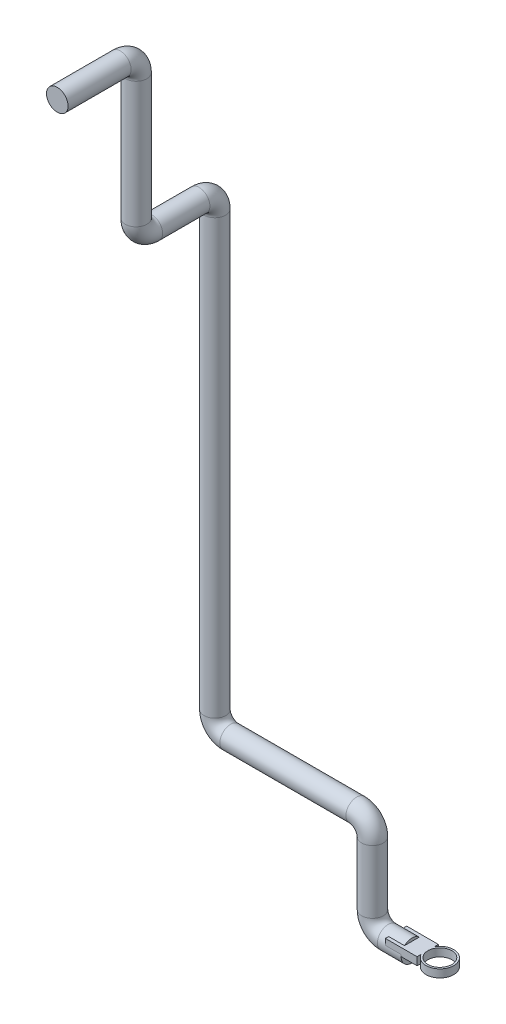
ISO-10303-21;
HEADER;
FILE_DESCRIPTION(('STEP AP214'),'2;1');
FILE_NAME('part.step','',(''),(''),'','','');
FILE_SCHEMA(('AUTOMOTIVE_DESIGN { 1 0 10303 214 1 1 1 1 }'));
ENDSEC;
DATA;
#1=APPLICATION_CONTEXT('core data for automotive mechanical design processes');
#2=APPLICATION_PROTOCOL_DEFINITION('international standard','automotive_design',2000,#1);
#3=PRODUCT_CONTEXT('',#1,'mechanical');
#4=PRODUCT('Part','Part','',(#3));
#5=PRODUCT_RELATED_PRODUCT_CATEGORY('part','',(#4));
#6=PRODUCT_DEFINITION_FORMATION('','',#4);
#7=PRODUCT_DEFINITION_CONTEXT('part definition',#1,'design');
#8=PRODUCT_DEFINITION('design','',#6,#7);
#9=PRODUCT_DEFINITION_SHAPE('','',#8);
#10=(LENGTH_UNIT() NAMED_UNIT(*) SI_UNIT(.MILLI.,.METRE.));
#11=(NAMED_UNIT(*) PLANE_ANGLE_UNIT() SI_UNIT($,.RADIAN.));
#12=(NAMED_UNIT(*) SI_UNIT($,.STERADIAN.) SOLID_ANGLE_UNIT());
#13=UNCERTAINTY_MEASURE_WITH_UNIT(LENGTH_MEASURE(1.E-05),#10,'distance_accuracy_value','');
#14=(GEOMETRIC_REPRESENTATION_CONTEXT(3) GLOBAL_UNCERTAINTY_ASSIGNED_CONTEXT((#13)) GLOBAL_UNIT_ASSIGNED_CONTEXT((#10,
#11,#12)) REPRESENTATION_CONTEXT('',''));
#15=CARTESIAN_POINT('',(0.,0.,0.));
#16=DIRECTION('',(0.,0.,1.));
#17=DIRECTION('',(1.,0.,0.));
#18=AXIS2_PLACEMENT_3D('',#15,#16,#17);
#19=CARTESIAN_POINT('',(20.1080513682243,10.,-13.5123844463082));
#20=DIRECTION('',(-1.,0.,0.));
#21=DIRECTION('',(0.,0.,1.));
#22=AXIS2_PLACEMENT_3D('',#19,#20,#21);
#23=PLANE('',#22);
#24=DIRECTION('',(0.,-1.,0.));
#25=VECTOR('',#24,1.);
#26=CARTESIAN_POINT('',(20.1080513682243,10.,-8.44177710397778));
#27=LINE('',#26,#25);
#28=CARTESIAN_POINT('',(20.1080513682243,0.,-8.44177710397778));
#29=VERTEX_POINT('',#28);
#30=CARTESIAN_POINT('',(20.1080513682243,10.,-8.44177710397778));
#31=VERTEX_POINT('',#30);
#32=EDGE_CURVE('E131',#29,#31,#27,.F.);
#33=ORIENTED_EDGE('',*,*,#32,.F.);
#34=DIRECTION('',(0.,0.,-1.));
#35=VECTOR('',#34,1.);
#36=CARTESIAN_POINT('',(20.1080513682243,0.,-13.5123844463082));
#37=LINE('',#36,#35);
#38=CARTESIAN_POINT('',(20.1080513682243,0.,-13.5123844463082));
#39=VERTEX_POINT('',#38);
#40=EDGE_CURVE('E121',#29,#39,#37,.T.);
#41=ORIENTED_EDGE('',*,*,#40,.T.);
#42=DIRECTION('',(0.,-1.,0.));
#43=VECTOR('',#42,1.);
#44=CARTESIAN_POINT('',(20.1080513682243,10.,-13.5123844463082));
#45=LINE('',#44,#43);
#46=CARTESIAN_POINT('',(20.1080513682243,10.,-13.5123844463082));
#47=VERTEX_POINT('',#46);
#48=EDGE_CURVE('E171',#47,#39,#45,.T.);
#49=ORIENTED_EDGE('',*,*,#48,.F.);
#50=DIRECTION('',(0.,0.,-1.));
#51=VECTOR('',#50,1.);
#52=CARTESIAN_POINT('',(20.1080513682243,10.,-13.5123844463082));
#53=LINE('',#52,#51);
#54=EDGE_CURVE('E51',#31,#47,#53,.T.);
#55=ORIENTED_EDGE('',*,*,#54,.F.);
#56=EDGE_LOOP('',(#33,#41,#49,#55));
#57=FACE_BOUND('',#56,.T.);
#58=ADVANCED_FACE('F36',(#57),#23,.F.);
#59=DIRECTION('',(0.,-1.,0.));
#60=VECTOR('',#59,1.);
#61=CARTESIAN_POINT('',(20.1080513682243,10.,8.44177710397778));
#62=LINE('',#61,#60);
#63=CARTESIAN_POINT('',(20.1080513682243,10.,8.44177710397778));
#64=VERTEX_POINT('',#63);
#65=CARTESIAN_POINT('',(20.1080513682243,0.,8.44177710397778));
#66=VERTEX_POINT('',#65);
#67=EDGE_CURVE('E59',#64,#66,#62,.T.);
#68=ORIENTED_EDGE('',*,*,#67,.F.);
#69=CARTESIAN_POINT('',(20.1080513682243,10.,13.5123844463082));
#70=VERTEX_POINT('',#69);
#71=EDGE_CURVE('E149',#70,#64,#53,.T.);
#72=ORIENTED_EDGE('',*,*,#71,.F.);
#73=DIRECTION('',(0.,-1.,0.));
#74=VECTOR('',#73,1.);
#75=CARTESIAN_POINT('',(20.1080513682243,10.,13.5123844463082));
#76=LINE('',#75,#74);
#77=CARTESIAN_POINT('',(20.1080513682243,0.,13.5123844463082));
#78=VERTEX_POINT('',#77);
#79=EDGE_CURVE('E158',#70,#78,#76,.T.);
#80=ORIENTED_EDGE('',*,*,#79,.T.);
#81=EDGE_CURVE('E130',#78,#66,#37,.T.);
#82=ORIENTED_EDGE('',*,*,#81,.T.);
#83=EDGE_LOOP('',(#68,#72,#80,#82));
#84=FACE_BOUND('',#83,.T.);
#85=ADVANCED_FACE('F278',(#84),#23,.F.);
#86=CARTESIAN_POINT('',(0.,0.,0.));
#87=DIRECTION('',(1.,0.,0.));
#88=DIRECTION('',(0.,0.,-1.));
#89=AXIS2_PLACEMENT_3D('',#86,#87,#88);
#90=PLANE('',#89);
#91=CARTESIAN_POINT('',(0.,0.,0.));
#92=DIRECTION('',(1.,0.,0.));
#93=DIRECTION('',(0.,0.,-1.));
#94=AXIS2_PLACEMENT_3D('',#91,#92,#93);
#95=CIRCLE('',#94,13.7);
#96=CARTESIAN_POINT('',(0.,0.,-13.7));
#97=VERTEX_POINT('',#96);
#98=CARTESIAN_POINT('',(0.,2.25952795405754,-13.5123844463082));
#99=VERTEX_POINT('',#98);
#100=EDGE_CURVE('E182',#97,#99,#95,.T.);
#101=ORIENTED_EDGE('',*,*,#100,.T.);
#102=DIRECTION('',(0.,-1.,0.));
#103=VECTOR('',#102,1.);
#104=CARTESIAN_POINT('',(0.,0.,-13.5123844463082));
#105=LINE('',#104,#103);
#106=CARTESIAN_POINT('',(0.,0.,-13.5123844463082));
#107=VERTEX_POINT('',#106);
#108=EDGE_CURVE('E178',#99,#107,#105,.T.);
#109=ORIENTED_EDGE('',*,*,#108,.T.);
#110=DIRECTION('',(0.,0.,1.));
#111=VECTOR('',#110,1.);
#112=CARTESIAN_POINT('',(0.,0.,0.));
#113=LINE('',#112,#111);
#114=CARTESIAN_POINT('',(0.,0.,13.5123844463082));
#115=VERTEX_POINT('',#114);
#116=EDGE_CURVE('E11',#107,#115,#113,.T.);
#117=ORIENTED_EDGE('',*,*,#116,.T.);
#118=DIRECTION('',(0.,1.,0.));
#119=VECTOR('',#118,1.);
#120=CARTESIAN_POINT('',(0.,0.,13.5123844463082));
#121=LINE('',#120,#119);
#122=CARTESIAN_POINT('',(0.,2.25952795405754,13.5123844463082));
#123=VERTEX_POINT('',#122);
#124=EDGE_CURVE('E175',#115,#123,#121,.T.);
#125=ORIENTED_EDGE('',*,*,#124,.T.);
#126=EDGE_CURVE('E181',#123,#97,#95,.T.);
#127=ORIENTED_EDGE('',*,*,#126,.T.);
#128=EDGE_LOOP('',(#101,#109,#117,#125,#127));
#129=FACE_BOUND('',#128,.T.);
#130=ADVANCED_FACE('F255',(#129),#90,.T.);
#131=CARTESIAN_POINT('',(0.,0.,0.));
#132=DIRECTION('',(-1.,0.,0.));
#133=DIRECTION('',(0.,0.,1.));
#134=AXIS2_PLACEMENT_3D('',#131,#132,#133);
#135=CYLINDRICAL_SURFACE('',#134,13.7);
#136=CARTESIAN_POINT('',(-30.,0.,0.));
#137=DIRECTION('',(1.,0.,0.));
#138=DIRECTION('',(0.,0.,-1.));
#139=AXIS2_PLACEMENT_3D('',#136,#137,#138);
#140=CIRCLE('',#139,13.7);
#141=CARTESIAN_POINT('',(-30.,-13.7,0.));
#142=VERTEX_POINT('',#141);
#143=EDGE_CURVE('E185',#142,#142,#140,.T.);
#144=ORIENTED_EDGE('',*,*,#143,.T.);
#145=EDGE_LOOP('',(#144));
#146=FACE_BOUND('',#145,.T.);
#147=DIRECTION('',(-1.,0.,0.));
#148=VECTOR('',#147,1.);
#149=CARTESIAN_POINT('',(0.,2.25952795405754,-13.5123844463082));
#150=LINE('',#149,#148);
#151=CARTESIAN_POINT('',(-20.1080513682243,2.25952795405754,-13.5123844463082));
#152=VERTEX_POINT('',#151);
#153=EDGE_CURVE('E44',#99,#152,#150,.T.);
#154=ORIENTED_EDGE('',*,*,#153,.F.);
#155=ORIENTED_EDGE('',*,*,#100,.F.);
#156=ORIENTED_EDGE('',*,*,#126,.F.);
#157=DIRECTION('',(-1.,0.,0.));
#158=VECTOR('',#157,1.);
#159=CARTESIAN_POINT('',(0.,2.25952795405754,13.5123844463082));
#160=LINE('',#159,#158);
#161=CARTESIAN_POINT('',(-20.1080513682243,2.25952795405754,13.5123844463082));
#162=VERTEX_POINT('',#161);
#163=EDGE_CURVE('E229',#162,#123,#160,.F.);
#164=ORIENTED_EDGE('',*,*,#163,.F.);
#165=CARTESIAN_POINT('',(-20.1080513682243,0.,0.));
#166=DIRECTION('',(1.,0.,0.));
#167=DIRECTION('',(0.,0.,-1.));
#168=AXIS2_PLACEMENT_3D('',#165,#166,#167);
#169=CIRCLE('',#168,13.7);
#170=CARTESIAN_POINT('',(-20.1080513682243,10.,9.36429388688757));
#171=VERTEX_POINT('',#170);
#172=EDGE_CURVE('E227',#171,#162,#169,.T.);
#173=ORIENTED_EDGE('',*,*,#172,.F.);
#174=DIRECTION('',(-1.,0.,0.));
#175=VECTOR('',#174,1.);
#176=CARTESIAN_POINT('',(0.,10.,9.36429388688757));
#177=LINE('',#176,#175);
#178=CARTESIAN_POINT('',(0.,10.,9.36429388688757));
#179=VERTEX_POINT('',#178);
#180=EDGE_CURVE('E224',#171,#179,#177,.F.);
#181=ORIENTED_EDGE('',*,*,#180,.T.);
#182=CARTESIAN_POINT('',(0.,10.,-9.36429388688757));
#183=VERTEX_POINT('',#182);
#184=EDGE_CURVE('E186',#183,#179,#95,.T.);
#185=ORIENTED_EDGE('',*,*,#184,.F.);
#186=DIRECTION('',(-1.,0.,0.));
#187=VECTOR('',#186,1.);
#188=CARTESIAN_POINT('',(0.,10.,-9.36429388688757));
#189=LINE('',#188,#187);
#190=CARTESIAN_POINT('',(-20.1080513682243,10.,-9.36429388688757));
#191=VERTEX_POINT('',#190);
#192=EDGE_CURVE('E232',#183,#191,#189,.T.);
#193=ORIENTED_EDGE('',*,*,#192,.T.);
#194=EDGE_CURVE('E230',#152,#191,#169,.T.);
#195=ORIENTED_EDGE('',*,*,#194,.F.);
#196=EDGE_LOOP('',(#154,#155,#156,#164,#173,#181,#185,#193,#195));
#197=FACE_BOUND('',#196,.T.);
#198=ADVANCED_FACE('F248',(#146,#197),#135,.T.);
#199=DIRECTION('',(0.,0.,1.));
#200=VECTOR('',#199,1.);
#201=CARTESIAN_POINT('',(0.,10.,0.));
#202=LINE('',#201,#200);
#203=EDGE_CURVE('E173',#183,#179,#202,.T.);
#204=ORIENTED_EDGE('',*,*,#203,.F.);
#205=ORIENTED_EDGE('',*,*,#184,.T.);
#206=EDGE_LOOP('',(#204,#205));
#207=FACE_BOUND('',#206,.T.);
#208=ADVANCED_FACE('F38',(#207),#90,.T.);
#209=CARTESIAN_POINT('',(-250.,909.98,200.));
#210=DIRECTION('',(0.,0.,-1.));
#211=DIRECTION('',(0.,1.,0.));
#212=AXIS2_PLACEMENT_3D('',#209,#210,#211);
#213=PLANE('',#212);
#214=CARTESIAN_POINT('',(-250.,909.98,200.));
#215=DIRECTION('',(0.,0.,-1.));
#216=DIRECTION('',(0.,1.,0.));
#217=AXIS2_PLACEMENT_3D('',#214,#215,#216);
#218=CIRCLE('',#217,13.7);
#219=CARTESIAN_POINT('',(-250.,923.68,200.));
#220=VERTEX_POINT('',#219);
#221=EDGE_CURVE('E222',#220,#220,#218,.T.);
#222=ORIENTED_EDGE('',*,*,#221,.F.);
#223=EDGE_LOOP('',(#222));
#224=FACE_BOUND('',#223,.T.);
#225=ADVANCED_FACE('F267',(#224),#213,.F.);
#226=CARTESIAN_POINT('',(-30.,20.,0.));
#227=DIRECTION('',(0.,0.,-1.));
#228=DIRECTION('',(-1.,0.,0.));
#229=AXIS2_PLACEMENT_3D('',#226,#227,#228);
#230=TOROIDAL_SURFACE('',#229,20.,13.7);
#231=CARTESIAN_POINT('',(-50.,20.,0.));
#232=DIRECTION('',(0.,-1.,0.));
#233=DIRECTION('',(0.,0.,-1.));
#234=AXIS2_PLACEMENT_3D('',#231,#232,#233);
#235=CIRCLE('',#234,13.7);
#236=CARTESIAN_POINT('',(-63.7,20.,0.));
#237=VERTEX_POINT('',#236);
#238=EDGE_CURVE('E189',#237,#237,#235,.T.);
#239=CARTESIAN_POINT('',(-30.,20.,0.));
#240=DIRECTION('',(0.,0.,-1.));
#241=DIRECTION('',(-1.,0.,0.));
#242=AXIS2_PLACEMENT_3D('',#239,#240,#241);
#243=CIRCLE('',#242,33.7);
#244=EDGE_CURVE('',#142,#237,#243,.T.);
#245=ORIENTED_EDGE('',*,*,#143,.F.);
#246=ORIENTED_EDGE('',*,*,#238,.T.);
#247=ORIENTED_EDGE('',*,*,#244,.T.);
#248=ORIENTED_EDGE('',*,*,#244,.F.);
#249=EDGE_LOOP('',(#245,#247,#246,#248));
#250=FACE_BOUND('',#249,.T.);
#251=ADVANCED_FACE('F272',(#250),#230,.T.);
#252=CARTESIAN_POINT('',(-50.,20.,0.));
#253=DIRECTION('',(0.,1.,0.));
#254=DIRECTION('',(0.,0.,1.));
#255=AXIS2_PLACEMENT_3D('',#252,#253,#254);
#256=CYLINDRICAL_SURFACE('',#255,13.7);
#257=CARTESIAN_POINT('',(-50.,100.,0.));
#258=DIRECTION('',(0.,-1.,0.));
#259=DIRECTION('',(0.,0.,-1.));
#260=AXIS2_PLACEMENT_3D('',#257,#258,#259);
#261=CIRCLE('',#260,13.7);
#262=CARTESIAN_POINT('',(-36.3,100.,0.));
#263=VERTEX_POINT('',#262);
#264=EDGE_CURVE('E192',#263,#263,#261,.T.);
#265=ORIENTED_EDGE('',*,*,#264,.T.);
#266=EDGE_LOOP('',(#265));
#267=FACE_BOUND('',#266,.T.);
#268=ORIENTED_EDGE('',*,*,#238,.F.);
#269=EDGE_LOOP('',(#268));
#270=FACE_BOUND('',#269,.T.);
#271=ADVANCED_FACE('F291',(#267,#270),#256,.T.);
#272=CARTESIAN_POINT('',(-70.,100.,0.));
#273=DIRECTION('',(0.,0.,1.));
#274=DIRECTION('',(1.,0.,0.));
#275=AXIS2_PLACEMENT_3D('',#272,#273,#274);
#276=TOROIDAL_SURFACE('',#275,20.,13.7);
#277=CARTESIAN_POINT('',(-70.,120.,0.));
#278=DIRECTION('',(1.,0.,0.));
#279=DIRECTION('',(0.,0.,-1.));
#280=AXIS2_PLACEMENT_3D('',#277,#278,#279);
#281=CIRCLE('',#280,13.7);
#282=CARTESIAN_POINT('',(-70.,133.7,0.));
#283=VERTEX_POINT('',#282);
#284=EDGE_CURVE('E195',#283,#283,#281,.T.);
#285=CARTESIAN_POINT('',(-70.,100.,0.));
#286=DIRECTION('',(0.,0.,1.));
#287=DIRECTION('',(1.,0.,0.));
#288=AXIS2_PLACEMENT_3D('',#285,#286,#287);
#289=CIRCLE('',#288,33.7);
#290=EDGE_CURVE('',#263,#283,#289,.T.);
#291=ORIENTED_EDGE('',*,*,#264,.F.);
#292=ORIENTED_EDGE('',*,*,#284,.T.);
#293=ORIENTED_EDGE('',*,*,#290,.T.);
#294=ORIENTED_EDGE('',*,*,#290,.F.);
#295=EDGE_LOOP('',(#291,#293,#292,#294));
#296=FACE_BOUND('',#295,.T.);
#297=ADVANCED_FACE('F295',(#296),#276,.T.);
#298=CARTESIAN_POINT('',(-70.,120.,0.));
#299=DIRECTION('',(-1.,0.,0.));
#300=DIRECTION('',(0.,-1.,0.));
#301=AXIS2_PLACEMENT_3D('',#298,#299,#300);
#302=CYLINDRICAL_SURFACE('',#301,13.7);
#303=CARTESIAN_POINT('',(-230.,120.,0.));
#304=DIRECTION('',(1.,0.,0.));
#305=DIRECTION('',(0.,0.,-1.));
#306=AXIS2_PLACEMENT_3D('',#303,#304,#305);
#307=CIRCLE('',#306,13.7);
#308=CARTESIAN_POINT('',(-230.,106.3,0.));
#309=VERTEX_POINT('',#308);
#310=EDGE_CURVE('E198',#309,#309,#307,.T.);
#311=ORIENTED_EDGE('',*,*,#310,.T.);
#312=EDGE_LOOP('',(#311));
#313=FACE_BOUND('',#312,.T.);
#314=ORIENTED_EDGE('',*,*,#284,.F.);
#315=EDGE_LOOP('',(#314));
#316=FACE_BOUND('',#315,.T.);
#317=ADVANCED_FACE('F299',(#313,#316),#302,.T.);
#318=CARTESIAN_POINT('',(-230.,140.,0.));
#319=DIRECTION('',(0.,0.,-1.));
#320=DIRECTION('',(-1.,0.,0.));
#321=AXIS2_PLACEMENT_3D('',#318,#319,#320);
#322=TOROIDAL_SURFACE('',#321,20.,13.7);
#323=CARTESIAN_POINT('',(-250.,140.,0.));
#324=DIRECTION('',(0.,-1.,0.));
#325=DIRECTION('',(0.,0.,-1.));
#326=AXIS2_PLACEMENT_3D('',#323,#324,#325);
#327=CIRCLE('',#326,13.7);
#328=CARTESIAN_POINT('',(-263.7,140.,0.));
#329=VERTEX_POINT('',#328);
#330=EDGE_CURVE('E201',#329,#329,#327,.T.);
#331=CARTESIAN_POINT('',(-230.,140.,0.));
#332=DIRECTION('',(0.,0.,-1.));
#333=DIRECTION('',(-1.,0.,0.));
#334=AXIS2_PLACEMENT_3D('',#331,#332,#333);
#335=CIRCLE('',#334,33.7);
#336=EDGE_CURVE('',#309,#329,#335,.T.);
#337=ORIENTED_EDGE('',*,*,#310,.F.);
#338=ORIENTED_EDGE('',*,*,#330,.T.);
#339=ORIENTED_EDGE('',*,*,#336,.T.);
#340=ORIENTED_EDGE('',*,*,#336,.F.);
#341=EDGE_LOOP('',(#337,#339,#338,#340));
#342=FACE_BOUND('',#341,.T.);
#343=ADVANCED_FACE('F303',(#342),#322,.T.);
#344=CARTESIAN_POINT('',(-250.,140.,0.));
#345=DIRECTION('',(0.,1.,0.));
#346=DIRECTION('',(0.,0.,1.));
#347=AXIS2_PLACEMENT_3D('',#344,#345,#346);
#348=CYLINDRICAL_SURFACE('',#347,13.7);
#349=CARTESIAN_POINT('',(-250.,689.98,0.));
#350=DIRECTION('',(0.,-1.,0.));
#351=DIRECTION('',(0.,0.,-1.));
#352=AXIS2_PLACEMENT_3D('',#349,#350,#351);
#353=CIRCLE('',#352,13.7);
#354=CARTESIAN_POINT('',(-250.,689.98,-13.7));
#355=VERTEX_POINT('',#354);
#356=EDGE_CURVE('E204',#355,#355,#353,.T.);
#357=ORIENTED_EDGE('',*,*,#356,.T.);
#358=EDGE_LOOP('',(#357));
#359=FACE_BOUND('',#358,.T.);
#360=ORIENTED_EDGE('',*,*,#330,.F.);
#361=EDGE_LOOP('',(#360));
#362=FACE_BOUND('',#361,.T.);
#363=ADVANCED_FACE('F307',(#359,#362),#348,.T.);
#364=CARTESIAN_POINT('',(-250.,689.98,20.));
#365=DIRECTION('',(1.,0.,0.));
#366=DIRECTION('',(0.,0.,-1.));
#367=AXIS2_PLACEMENT_3D('',#364,#365,#366);
#368=TOROIDAL_SURFACE('',#367,20.,13.7);
#369=CARTESIAN_POINT('',(-250.,709.98,20.));
#370=DIRECTION('',(0.,0.,-1.));
#371=DIRECTION('',(0.,1.,0.));
#372=AXIS2_PLACEMENT_3D('',#369,#370,#371);
#373=CIRCLE('',#372,13.7);
#374=CARTESIAN_POINT('',(-250.,723.68,20.));
#375=VERTEX_POINT('',#374);
#376=EDGE_CURVE('E207',#375,#375,#373,.T.);
#377=CARTESIAN_POINT('',(-250.,689.98,20.));
#378=DIRECTION('',(1.,0.,0.));
#379=DIRECTION('',(0.,0.,-1.));
#380=AXIS2_PLACEMENT_3D('',#377,#378,#379);
#381=CIRCLE('',#380,33.7);
#382=EDGE_CURVE('',#355,#375,#381,.T.);
#383=ORIENTED_EDGE('',*,*,#356,.F.);
#384=ORIENTED_EDGE('',*,*,#376,.T.);
#385=ORIENTED_EDGE('',*,*,#382,.T.);
#386=ORIENTED_EDGE('',*,*,#382,.F.);
#387=EDGE_LOOP('',(#383,#385,#384,#386));
#388=FACE_BOUND('',#387,.T.);
#389=ADVANCED_FACE('F311',(#388),#368,.T.);
#390=CARTESIAN_POINT('',(-250.,709.98,20.));
#391=DIRECTION('',(0.,0.,1.));
#392=DIRECTION('',(1.,0.,0.));
#393=AXIS2_PLACEMENT_3D('',#390,#391,#392);
#394=CYLINDRICAL_SURFACE('',#393,13.7);
#395=CARTESIAN_POINT('',(-250.,709.98,80.));
#396=DIRECTION('',(0.,0.,-1.));
#397=DIRECTION('',(0.,1.,0.));
#398=AXIS2_PLACEMENT_3D('',#395,#396,#397);
#399=CIRCLE('',#398,13.7);
#400=CARTESIAN_POINT('',(-250.,696.28,80.));
#401=VERTEX_POINT('',#400);
#402=EDGE_CURVE('E210',#401,#401,#399,.T.);
#403=ORIENTED_EDGE('',*,*,#402,.T.);
#404=EDGE_LOOP('',(#403));
#405=FACE_BOUND('',#404,.T.);
#406=ORIENTED_EDGE('',*,*,#376,.F.);
#407=EDGE_LOOP('',(#406));
#408=FACE_BOUND('',#407,.T.);
#409=ADVANCED_FACE('F315',(#405,#408),#394,.T.);
#410=CARTESIAN_POINT('',(-250.,729.98,80.));
#411=DIRECTION('',(-1.,0.,0.));
#412=DIRECTION('',(0.,0.,1.));
#413=AXIS2_PLACEMENT_3D('',#410,#411,#412);
#414=TOROIDAL_SURFACE('',#413,20.,13.7);
#415=CARTESIAN_POINT('',(-250.,729.98,100.));
#416=DIRECTION('',(0.,-1.,0.));
#417=DIRECTION('',(0.,0.,-1.));
#418=AXIS2_PLACEMENT_3D('',#415,#416,#417);
#419=CIRCLE('',#418,13.7);
#420=CARTESIAN_POINT('',(-250.,729.98,113.7));
#421=VERTEX_POINT('',#420);
#422=EDGE_CURVE('E213',#421,#421,#419,.T.);
#423=CARTESIAN_POINT('',(-250.,729.98,80.));
#424=DIRECTION('',(-1.,0.,0.));
#425=DIRECTION('',(0.,0.,1.));
#426=AXIS2_PLACEMENT_3D('',#423,#424,#425);
#427=CIRCLE('',#426,33.7);
#428=EDGE_CURVE('',#401,#421,#427,.T.);
#429=ORIENTED_EDGE('',*,*,#402,.F.);
#430=ORIENTED_EDGE('',*,*,#422,.T.);
#431=ORIENTED_EDGE('',*,*,#428,.T.);
#432=ORIENTED_EDGE('',*,*,#428,.F.);
#433=EDGE_LOOP('',(#429,#431,#430,#432));
#434=FACE_BOUND('',#433,.T.);
#435=ADVANCED_FACE('F319',(#434),#414,.T.);
#436=CARTESIAN_POINT('',(-250.,729.98,100.));
#437=DIRECTION('',(0.,1.,0.));
#438=DIRECTION('',(0.,0.,1.));
#439=AXIS2_PLACEMENT_3D('',#436,#437,#438);
#440=CYLINDRICAL_SURFACE('',#439,13.7);
#441=CARTESIAN_POINT('',(-250.,889.98,100.));
#442=DIRECTION('',(0.,-1.,0.));
#443=DIRECTION('',(0.,0.,-1.));
#444=AXIS2_PLACEMENT_3D('',#441,#442,#443);
#445=CIRCLE('',#444,13.7);
#446=CARTESIAN_POINT('',(-250.,889.98,86.3));
#447=VERTEX_POINT('',#446);
#448=EDGE_CURVE('E216',#447,#447,#445,.T.);
#449=ORIENTED_EDGE('',*,*,#448,.T.);
#450=EDGE_LOOP('',(#449));
#451=FACE_BOUND('',#450,.T.);
#452=ORIENTED_EDGE('',*,*,#422,.F.);
#453=EDGE_LOOP('',(#452));
#454=FACE_BOUND('',#453,.T.);
#455=ADVANCED_FACE('F323',(#451,#454),#440,.T.);
#456=CARTESIAN_POINT('',(-250.,889.98,120.));
#457=DIRECTION('',(1.,0.,0.));
#458=DIRECTION('',(0.,0.,-1.));
#459=AXIS2_PLACEMENT_3D('',#456,#457,#458);
#460=TOROIDAL_SURFACE('',#459,20.,13.7);
#461=CARTESIAN_POINT('',(-250.,909.98,120.));
#462=DIRECTION('',(0.,0.,-1.));
#463=DIRECTION('',(0.,1.,0.));
#464=AXIS2_PLACEMENT_3D('',#461,#462,#463);
#465=CIRCLE('',#464,13.7);
#466=CARTESIAN_POINT('',(-250.,923.68,120.));
#467=VERTEX_POINT('',#466);
#468=EDGE_CURVE('E219',#467,#467,#465,.T.);
#469=CARTESIAN_POINT('',(-250.,889.98,120.));
#470=DIRECTION('',(1.,0.,0.));
#471=DIRECTION('',(0.,0.,-1.));
#472=AXIS2_PLACEMENT_3D('',#469,#470,#471);
#473=CIRCLE('',#472,33.7);
#474=EDGE_CURVE('',#447,#467,#473,.T.);
#475=ORIENTED_EDGE('',*,*,#448,.F.);
#476=ORIENTED_EDGE('',*,*,#468,.T.);
#477=ORIENTED_EDGE('',*,*,#474,.T.);
#478=ORIENTED_EDGE('',*,*,#474,.F.);
#479=EDGE_LOOP('',(#475,#477,#476,#478));
#480=FACE_BOUND('',#479,.T.);
#481=ADVANCED_FACE('F327',(#480),#460,.T.);
#482=CARTESIAN_POINT('',(-250.,909.98,120.));
#483=DIRECTION('',(0.,0.,1.));
#484=DIRECTION('',(1.,0.,0.));
#485=AXIS2_PLACEMENT_3D('',#482,#483,#484);
#486=CYLINDRICAL_SURFACE('',#485,13.7);
#487=ORIENTED_EDGE('',*,*,#221,.T.);
#488=EDGE_LOOP('',(#487));
#489=FACE_BOUND('',#488,.T.);
#490=ORIENTED_EDGE('',*,*,#468,.F.);
#491=EDGE_LOOP('',(#490));
#492=FACE_BOUND('',#491,.T.);
#493=ADVANCED_FACE('F276',(#489,#492),#486,.T.);
#494=CARTESIAN_POINT('',(-20.1080513682243,10.,-13.5123844463082));
#495=DIRECTION('',(1.,0.,0.));
#496=DIRECTION('',(0.,0.,-1.));
#497=AXIS2_PLACEMENT_3D('',#494,#495,#496);
#498=PLANE('',#497);
#499=DIRECTION('',(0.,-1.,0.));
#500=VECTOR('',#499,1.);
#501=CARTESIAN_POINT('',(-20.1080513682243,10.,-13.5123844463082));
#502=LINE('',#501,#500);
#503=CARTESIAN_POINT('',(-20.1080513682243,10.,-13.5123844463082));
#504=VERTEX_POINT('',#503);
#505=EDGE_CURVE('E168',#504,#152,#502,.T.);
#506=ORIENTED_EDGE('',*,*,#505,.T.);
#507=ORIENTED_EDGE('',*,*,#194,.T.);
#508=DIRECTION('',(0.,0.,1.));
#509=VECTOR('',#508,1.);
#510=CARTESIAN_POINT('',(-20.1080513682243,10.,-13.5123844463082));
#511=LINE('',#510,#509);
#512=EDGE_CURVE('E154',#504,#191,#511,.T.);
#513=ORIENTED_EDGE('',*,*,#512,.F.);
#514=EDGE_LOOP('',(#506,#507,#513));
#515=FACE_BOUND('',#514,.T.);
#516=ADVANCED_FACE('F240',(#515),#498,.F.);
#517=CARTESIAN_POINT('',(0.,10.,0.));
#518=DIRECTION('',(0.,1.,0.));
#519=DIRECTION('',(0.,0.,1.));
#520=AXIS2_PLACEMENT_3D('',#517,#518,#519);
#521=PLANE('',#520);
#522=ORIENTED_EDGE('',*,*,#71,.T.);
#523=CARTESIAN_POINT('',(35.5497959439098,10.,0.));
#524=DIRECTION('',(0.,1.,0.));
#525=DIRECTION('',(0.,0.,1.));
#526=AXIS2_PLACEMENT_3D('',#523,#524,#525);
#527=CIRCLE('',#526,17.5986100648306);
#528=EDGE_CURVE('E142',#64,#31,#527,.T.);
#529=ORIENTED_EDGE('',*,*,#528,.T.);
#530=ORIENTED_EDGE('',*,*,#54,.T.);
#531=DIRECTION('',(-1.,0.,0.));
#532=VECTOR('',#531,1.);
#533=CARTESIAN_POINT('',(-20.1080513682243,10.,-13.5123844463082));
#534=LINE('',#533,#532);
#535=EDGE_CURVE('E151',#47,#504,#534,.T.);
#536=ORIENTED_EDGE('',*,*,#535,.T.);
#537=ORIENTED_EDGE('',*,*,#512,.T.);
#538=ORIENTED_EDGE('',*,*,#192,.F.);
#539=ORIENTED_EDGE('',*,*,#203,.T.);
#540=ORIENTED_EDGE('',*,*,#180,.F.);
#541=CARTESIAN_POINT('',(-20.1080513682243,10.,13.5123844463082));
#542=VERTEX_POINT('',#541);
#543=EDGE_CURVE('E153',#171,#542,#511,.T.);
#544=ORIENTED_EDGE('',*,*,#543,.T.);
#545=DIRECTION('',(1.,0.,0.));
#546=VECTOR('',#545,1.);
#547=CARTESIAN_POINT('',(-20.1080513682243,10.,13.5123844463082));
#548=LINE('',#547,#546);
#549=EDGE_CURVE('E157',#542,#70,#548,.T.);
#550=ORIENTED_EDGE('',*,*,#549,.T.);
#551=EDGE_LOOP('',(#522,#529,#530,#536,#537,#538,#539,#540,#544,#550));
#552=FACE_BOUND('',#551,.T.);
#553=CARTESIAN_POINT('',(35.5497959439098,10.,0.));
#554=DIRECTION('',(0.,1.,0.));
#555=DIRECTION('',(0.,0.,1.));
#556=AXIS2_PLACEMENT_3D('',#553,#554,#555);
#557=CIRCLE('',#556,15.1837886749991);
#558=CARTESIAN_POINT('',(35.5497959439098,10.,15.1837886749991));
#559=VERTEX_POINT('',#558);
#560=EDGE_CURVE('E138',#559,#559,#557,.T.);
#561=ORIENTED_EDGE('',*,*,#560,.F.);
#562=EDGE_LOOP('',(#561));
#563=FACE_BOUND('',#562,.T.);
#564=ADVANCED_FACE('F243',(#552,#563),#521,.T.);
#565=CARTESIAN_POINT('',(-20.1080513682243,10.,-13.5123844463082));
#566=DIRECTION('',(0.,0.,1.));
#567=DIRECTION('',(1.,0.,0.));
#568=AXIS2_PLACEMENT_3D('',#565,#566,#567);
#569=PLANE('',#568);
#570=ORIENTED_EDGE('',*,*,#108,.F.);
#571=ORIENTED_EDGE('',*,*,#153,.T.);
#572=ORIENTED_EDGE('',*,*,#505,.F.);
#573=ORIENTED_EDGE('',*,*,#535,.F.);
#574=ORIENTED_EDGE('',*,*,#48,.T.);
#575=DIRECTION('',(-1.,0.,0.));
#576=VECTOR('',#575,1.);
#577=CARTESIAN_POINT('',(-20.1080513682243,0.,-13.5123844463082));
#578=LINE('',#577,#576);
#579=EDGE_CURVE('E128',#39,#107,#578,.T.);
#580=ORIENTED_EDGE('',*,*,#579,.T.);
#581=EDGE_LOOP('',(#570,#571,#572,#573,#574,#580));
#582=FACE_BOUND('',#581,.T.);
#583=ADVANCED_FACE('F287',(#582),#569,.F.);
#584=ORIENTED_EDGE('',*,*,#543,.F.);
#585=ORIENTED_EDGE('',*,*,#172,.T.);
#586=DIRECTION('',(0.,-1.,0.));
#587=VECTOR('',#586,1.);
#588=CARTESIAN_POINT('',(-20.1080513682243,10.,13.5123844463082));
#589=LINE('',#588,#587);
#590=EDGE_CURVE('E165',#542,#162,#589,.T.);
#591=ORIENTED_EDGE('',*,*,#590,.F.);
#592=EDGE_LOOP('',(#584,#585,#591));
#593=FACE_BOUND('',#592,.T.);
#594=ADVANCED_FACE('F265',(#593),#498,.F.);
#595=CARTESIAN_POINT('',(-20.1080513682243,10.,13.5123844463082));
#596=DIRECTION('',(0.,0.,-1.));
#597=DIRECTION('',(-1.,0.,0.));
#598=AXIS2_PLACEMENT_3D('',#595,#596,#597);
#599=PLANE('',#598);
#600=ORIENTED_EDGE('',*,*,#124,.F.);
#601=DIRECTION('',(1.,0.,0.));
#602=VECTOR('',#601,1.);
#603=CARTESIAN_POINT('',(-20.1080513682243,0.,13.5123844463082));
#604=LINE('',#603,#602);
#605=EDGE_CURVE('E161',#115,#78,#604,.T.);
#606=ORIENTED_EDGE('',*,*,#605,.T.);
#607=ORIENTED_EDGE('',*,*,#79,.F.);
#608=ORIENTED_EDGE('',*,*,#549,.F.);
#609=ORIENTED_EDGE('',*,*,#590,.T.);
#610=ORIENTED_EDGE('',*,*,#163,.T.);
#611=EDGE_LOOP('',(#600,#606,#607,#608,#609,#610));
#612=FACE_BOUND('',#611,.T.);
#613=ADVANCED_FACE('F258',(#612),#599,.F.);
#614=CARTESIAN_POINT('',(0.,0.,0.));
#615=DIRECTION('',(0.,1.,0.));
#616=DIRECTION('',(0.,0.,1.));
#617=AXIS2_PLACEMENT_3D('',#614,#615,#616);
#618=PLANE('',#617);
#619=ORIENTED_EDGE('',*,*,#40,.F.);
#620=CARTESIAN_POINT('',(35.5497959439098,0.,0.));
#621=DIRECTION('',(0.,1.,0.));
#622=DIRECTION('',(0.,0.,1.));
#623=AXIS2_PLACEMENT_3D('',#620,#621,#622);
#624=CIRCLE('',#623,17.5986100648306);
#625=EDGE_CURVE('E126',#66,#29,#624,.T.);
#626=ORIENTED_EDGE('',*,*,#625,.F.);
#627=ORIENTED_EDGE('',*,*,#81,.F.);
#628=ORIENTED_EDGE('',*,*,#605,.F.);
#629=ORIENTED_EDGE('',*,*,#116,.F.);
#630=ORIENTED_EDGE('',*,*,#579,.F.);
#631=EDGE_LOOP('',(#619,#626,#627,#628,#629,#630));
#632=FACE_BOUND('',#631,.T.);
#633=CARTESIAN_POINT('',(35.5497959439098,0.,0.));
#634=DIRECTION('',(0.,1.,0.));
#635=DIRECTION('',(0.,0.,1.));
#636=AXIS2_PLACEMENT_3D('',#633,#634,#635);
#637=CIRCLE('',#636,15.1837886749991);
#638=CARTESIAN_POINT('',(35.5497959439098,0.,15.1837886749991));
#639=VERTEX_POINT('',#638);
#640=EDGE_CURVE('E139',#639,#639,#637,.T.);
#641=ORIENTED_EDGE('',*,*,#640,.T.);
#642=EDGE_LOOP('',(#641));
#643=FACE_BOUND('',#642,.T.);
#644=ADVANCED_FACE('F122',(#632,#643),#618,.F.);
#645=CARTESIAN_POINT('',(35.5497959439098,10.,0.));
#646=DIRECTION('',(0.,-1.,0.));
#647=DIRECTION('',(0.,0.,-1.));
#648=AXIS2_PLACEMENT_3D('',#645,#646,#647);
#649=CYLINDRICAL_SURFACE('',#648,17.5986100648306);
#650=ORIENTED_EDGE('',*,*,#625,.T.);
#651=ORIENTED_EDGE('',*,*,#32,.T.);
#652=ORIENTED_EDGE('',*,*,#528,.F.);
#653=ORIENTED_EDGE('',*,*,#67,.T.);
#654=EDGE_LOOP('',(#650,#651,#652,#653));
#655=FACE_BOUND('',#654,.T.);
#656=ADVANCED_FACE('F137',(#655),#649,.T.);
#657=CARTESIAN_POINT('',(35.5497959439098,10.,0.));
#658=DIRECTION('',(0.,-1.,0.));
#659=DIRECTION('',(0.,0.,-1.));
#660=AXIS2_PLACEMENT_3D('',#657,#658,#659);
#661=CYLINDRICAL_SURFACE('',#660,15.1837886749991);
#662=ORIENTED_EDGE('',*,*,#560,.T.);
#663=EDGE_LOOP('',(#662));
#664=FACE_BOUND('',#663,.T.);
#665=ORIENTED_EDGE('',*,*,#640,.F.);
#666=EDGE_LOOP('',(#665));
#667=FACE_BOUND('',#666,.T.);
#668=ADVANCED_FACE('F403',(#664,#667),#661,.F.);
#669=CLOSED_SHELL('',(#58,#85,#130,#198,#208,#225,#251,#271,#297,#317,#343,#363,#389,#409,#435,
#455,#481,#493,#516,#564,#583,#594,#613,#644,#656,#668));
#670=MANIFOLD_SOLID_BREP('B2',#669);
#671=ADVANCED_BREP_SHAPE_REPRESENTATION('',(#18,#670),#14);
#672=SHAPE_DEFINITION_REPRESENTATION(#9,#671);
ENDSEC;
END-ISO-10303-21;
